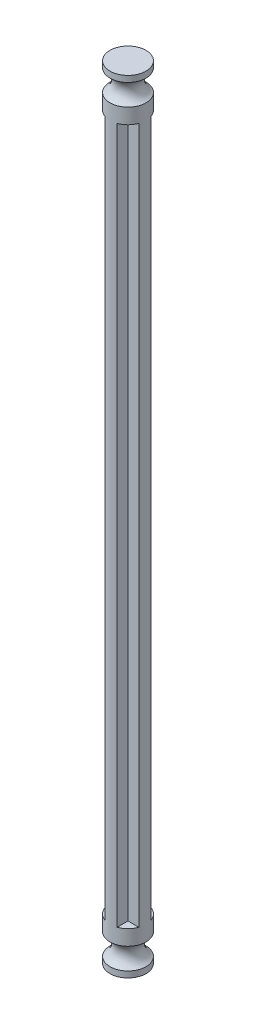
ISO-10303-21;
HEADER;
FILE_DESCRIPTION(('STEP AP214'),'2;1');
FILE_NAME('part.step','',(''),(''),'','','');
FILE_SCHEMA(('AUTOMOTIVE_DESIGN { 1 0 10303 214 1 1 1 1 }'));
ENDSEC;
DATA;
#1=APPLICATION_CONTEXT('core data for automotive mechanical design processes');
#2=APPLICATION_PROTOCOL_DEFINITION('international standard','automotive_design',2000,#1);
#3=PRODUCT_CONTEXT('',#1,'mechanical');
#4=PRODUCT('Part','Part','',(#3));
#5=PRODUCT_RELATED_PRODUCT_CATEGORY('part','',(#4));
#6=PRODUCT_DEFINITION_FORMATION('','',#4);
#7=PRODUCT_DEFINITION_CONTEXT('part definition',#1,'design');
#8=PRODUCT_DEFINITION('design','',#6,#7);
#9=PRODUCT_DEFINITION_SHAPE('','',#8);
#10=(LENGTH_UNIT() NAMED_UNIT(*) SI_UNIT(.MILLI.,.METRE.));
#11=(NAMED_UNIT(*) PLANE_ANGLE_UNIT() SI_UNIT($,.RADIAN.));
#12=(NAMED_UNIT(*) SI_UNIT($,.STERADIAN.) SOLID_ANGLE_UNIT());
#13=UNCERTAINTY_MEASURE_WITH_UNIT(LENGTH_MEASURE(1.E-05),#10,'distance_accuracy_value','');
#14=(GEOMETRIC_REPRESENTATION_CONTEXT(3) GLOBAL_UNCERTAINTY_ASSIGNED_CONTEXT((#13)) GLOBAL_UNIT_ASSIGNED_CONTEXT((#10,
#11,#12)) REPRESENTATION_CONTEXT('',''));
#15=CARTESIAN_POINT('',(0.,0.,0.));
#16=DIRECTION('',(0.,0.,1.));
#17=DIRECTION('',(1.,0.,0.));
#18=AXIS2_PLACEMENT_3D('',#15,#16,#17);
#19=CARTESIAN_POINT('',(1.,114.,1.));
#20=DIRECTION('',(-1.,0.,0.));
#21=DIRECTION('',(0.,0.,1.));
#22=AXIS2_PLACEMENT_3D('',#19,#20,#21);
#23=PLANE('',#22);
#24=DIRECTION('',(0.,0.,-1.));
#25=VECTOR('',#24,1.);
#26=CARTESIAN_POINT('',(1.,0.,1.));
#27=LINE('',#26,#25);
#28=CARTESIAN_POINT('',(1.,0.,2.77533781727558));
#29=VERTEX_POINT('',#28);
#30=CARTESIAN_POINT('',(1.,0.,1.));
#31=VERTEX_POINT('',#30);
#32=EDGE_CURVE('E122',#29,#31,#27,.T.);
#33=ORIENTED_EDGE('',*,*,#32,.T.);
#34=DIRECTION('',(0.,-1.,0.));
#35=VECTOR('',#34,1.);
#36=CARTESIAN_POINT('',(1.,114.,1.));
#37=LINE('',#36,#35);
#38=CARTESIAN_POINT('',(1.,114.,1.));
#39=VERTEX_POINT('',#38);
#40=EDGE_CURVE('E11',#39,#31,#37,.T.);
#41=ORIENTED_EDGE('',*,*,#40,.F.);
#42=DIRECTION('',(0.,0.,-1.));
#43=VECTOR('',#42,1.);
#44=CARTESIAN_POINT('',(1.,114.,1.));
#45=LINE('',#44,#43);
#46=CARTESIAN_POINT('',(0.999999999999999,114.,2.77533781727558));
#47=VERTEX_POINT('',#46);
#48=EDGE_CURVE('E139',#47,#39,#45,.T.);
#49=ORIENTED_EDGE('',*,*,#48,.F.);
#50=DIRECTION('',(0.,-1.,0.));
#51=VECTOR('',#50,1.);
#52=CARTESIAN_POINT('',(0.999999999999999,114.,2.77533781727558));
#53=LINE('',#52,#51);
#54=EDGE_CURVE('E52',#47,#29,#53,.T.);
#55=ORIENTED_EDGE('',*,*,#54,.T.);
#56=EDGE_LOOP('',(#33,#41,#49,#55));
#57=FACE_BOUND('',#56,.T.);
#58=ADVANCED_FACE('F37',(#57),#23,.F.);
#59=CARTESIAN_POINT('',(1.,114.,1.));
#60=DIRECTION('',(0.,0.,-1.));
#61=DIRECTION('',(-1.,0.,0.));
#62=AXIS2_PLACEMENT_3D('',#59,#60,#61);
#63=PLANE('',#62);
#64=DIRECTION('',(1.,0.,0.));
#65=VECTOR('',#64,1.);
#66=CARTESIAN_POINT('',(1.,0.,1.));
#67=LINE('',#66,#65);
#68=CARTESIAN_POINT('',(2.77533781727558,0.,1.));
#69=VERTEX_POINT('',#68);
#70=EDGE_CURVE('E126',#31,#69,#67,.T.);
#71=ORIENTED_EDGE('',*,*,#70,.T.);
#72=DIRECTION('',(0.,-1.,0.));
#73=VECTOR('',#72,1.);
#74=CARTESIAN_POINT('',(2.77533781727558,114.,1.));
#75=LINE('',#74,#73);
#76=CARTESIAN_POINT('',(2.77533781727558,114.,1.));
#77=VERTEX_POINT('',#76);
#78=EDGE_CURVE('E45',#77,#69,#75,.T.);
#79=ORIENTED_EDGE('',*,*,#78,.F.);
#80=DIRECTION('',(1.,0.,0.));
#81=VECTOR('',#80,1.);
#82=CARTESIAN_POINT('',(1.,114.,1.));
#83=LINE('',#82,#81);
#84=EDGE_CURVE('E213',#39,#77,#83,.T.);
#85=ORIENTED_EDGE('',*,*,#84,.F.);
#86=ORIENTED_EDGE('',*,*,#40,.T.);
#87=EDGE_LOOP('',(#71,#79,#85,#86));
#88=FACE_BOUND('',#87,.T.);
#89=ADVANCED_FACE('F277',(#88),#63,.F.);
#90=CARTESIAN_POINT('',(1.,114.,-1.));
#91=DIRECTION('',(0.,0.,1.));
#92=DIRECTION('',(1.,0.,0.));
#93=AXIS2_PLACEMENT_3D('',#90,#91,#92);
#94=PLANE('',#93);
#95=DIRECTION('',(-1.,0.,0.));
#96=VECTOR('',#95,1.);
#97=CARTESIAN_POINT('',(1.,0.,-1.));
#98=LINE('',#97,#96);
#99=CARTESIAN_POINT('',(2.77533781727558,0.,-1.));
#100=VERTEX_POINT('',#99);
#101=CARTESIAN_POINT('',(1.,0.,-1.));
#102=VERTEX_POINT('',#101);
#103=EDGE_CURVE('E180',#100,#102,#98,.T.);
#104=ORIENTED_EDGE('',*,*,#103,.T.);
#105=DIRECTION('',(0.,-1.,0.));
#106=VECTOR('',#105,1.);
#107=CARTESIAN_POINT('',(1.,114.,-1.));
#108=LINE('',#107,#106);
#109=CARTESIAN_POINT('',(1.,114.,-1.));
#110=VERTEX_POINT('',#109);
#111=EDGE_CURVE('E171',#110,#102,#108,.T.);
#112=ORIENTED_EDGE('',*,*,#111,.F.);
#113=DIRECTION('',(-1.,0.,0.));
#114=VECTOR('',#113,1.);
#115=CARTESIAN_POINT('',(1.,114.,-1.));
#116=LINE('',#115,#114);
#117=CARTESIAN_POINT('',(2.77533781727558,114.,-1.));
#118=VERTEX_POINT('',#117);
#119=EDGE_CURVE('E182',#118,#110,#116,.T.);
#120=ORIENTED_EDGE('',*,*,#119,.F.);
#121=DIRECTION('',(0.,-1.,0.));
#122=VECTOR('',#121,1.);
#123=CARTESIAN_POINT('',(2.77533781727558,114.,-1.));
#124=LINE('',#123,#122);
#125=EDGE_CURVE('E174',#118,#100,#124,.T.);
#126=ORIENTED_EDGE('',*,*,#125,.T.);
#127=EDGE_LOOP('',(#104,#112,#120,#126));
#128=FACE_BOUND('',#127,.T.);
#129=ADVANCED_FACE('F179',(#128),#94,.F.);
#130=CARTESIAN_POINT('',(1.,114.,-1.));
#131=DIRECTION('',(-1.,0.,0.));
#132=DIRECTION('',(0.,0.,1.));
#133=AXIS2_PLACEMENT_3D('',#130,#131,#132);
#134=PLANE('',#133);
#135=DIRECTION('',(0.,0.,-1.));
#136=VECTOR('',#135,1.);
#137=CARTESIAN_POINT('',(1.,0.,-1.));
#138=LINE('',#137,#136);
#139=CARTESIAN_POINT('',(0.999999999999999,0.,-2.77533781727558));
#140=VERTEX_POINT('',#139);
#141=EDGE_CURVE('E230',#102,#140,#138,.T.);
#142=ORIENTED_EDGE('',*,*,#141,.T.);
#143=DIRECTION('',(0.,-1.,0.));
#144=VECTOR('',#143,1.);
#145=CARTESIAN_POINT('',(1.,114.,-2.77533781727558));
#146=LINE('',#145,#144);
#147=CARTESIAN_POINT('',(1.,114.,-2.77533781727558));
#148=VERTEX_POINT('',#147);
#149=EDGE_CURVE('E168',#148,#140,#146,.T.);
#150=ORIENTED_EDGE('',*,*,#149,.F.);
#151=DIRECTION('',(0.,0.,-1.));
#152=VECTOR('',#151,1.);
#153=CARTESIAN_POINT('',(1.,114.,-1.));
#154=LINE('',#153,#152);
#155=EDGE_CURVE('E217',#110,#148,#154,.T.);
#156=ORIENTED_EDGE('',*,*,#155,.F.);
#157=ORIENTED_EDGE('',*,*,#111,.T.);
#158=EDGE_LOOP('',(#142,#150,#156,#157));
#159=FACE_BOUND('',#158,.T.);
#160=ADVANCED_FACE('F266',(#159),#134,.F.);
#161=CARTESIAN_POINT('',(-1.,114.,-1.));
#162=DIRECTION('',(1.,0.,0.));
#163=DIRECTION('',(0.,0.,-1.));
#164=AXIS2_PLACEMENT_3D('',#161,#162,#163);
#165=PLANE('',#164);
#166=DIRECTION('',(0.,0.,1.));
#167=VECTOR('',#166,1.);
#168=CARTESIAN_POINT('',(-1.,0.,-1.));
#169=LINE('',#168,#167);
#170=CARTESIAN_POINT('',(-1.,0.,-2.77533781727558));
#171=VERTEX_POINT('',#170);
#172=CARTESIAN_POINT('',(-1.,0.,-1.));
#173=VERTEX_POINT('',#172);
#174=EDGE_CURVE('E232',#171,#173,#169,.T.);
#175=ORIENTED_EDGE('',*,*,#174,.T.);
#176=DIRECTION('',(0.,-1.,0.));
#177=VECTOR('',#176,1.);
#178=CARTESIAN_POINT('',(-1.,114.,-1.));
#179=LINE('',#178,#177);
#180=CARTESIAN_POINT('',(-1.,114.,-1.));
#181=VERTEX_POINT('',#180);
#182=EDGE_CURVE('E162',#181,#173,#179,.T.);
#183=ORIENTED_EDGE('',*,*,#182,.F.);
#184=DIRECTION('',(0.,0.,1.));
#185=VECTOR('',#184,1.);
#186=CARTESIAN_POINT('',(-1.,114.,-1.));
#187=LINE('',#186,#185);
#188=CARTESIAN_POINT('',(-1.,114.,-2.77533781727558));
#189=VERTEX_POINT('',#188);
#190=EDGE_CURVE('E220',#189,#181,#187,.T.);
#191=ORIENTED_EDGE('',*,*,#190,.F.);
#192=DIRECTION('',(0.,-1.,0.));
#193=VECTOR('',#192,1.);
#194=CARTESIAN_POINT('',(-1.,114.,-2.77533781727558));
#195=LINE('',#194,#193);
#196=EDGE_CURVE('E165',#189,#171,#195,.T.);
#197=ORIENTED_EDGE('',*,*,#196,.T.);
#198=EDGE_LOOP('',(#175,#183,#191,#197));
#199=FACE_BOUND('',#198,.T.);
#200=ADVANCED_FACE('F264',(#199),#165,.F.);
#201=CARTESIAN_POINT('',(-1.,114.,-1.));
#202=DIRECTION('',(0.,0.,1.));
#203=DIRECTION('',(1.,0.,0.));
#204=AXIS2_PLACEMENT_3D('',#201,#202,#203);
#205=PLANE('',#204);
#206=DIRECTION('',(-1.,0.,0.));
#207=VECTOR('',#206,1.);
#208=CARTESIAN_POINT('',(-1.,0.,-1.));
#209=LINE('',#208,#207);
#210=CARTESIAN_POINT('',(-2.77533781727558,0.,-1.));
#211=VERTEX_POINT('',#210);
#212=EDGE_CURVE('E235',#173,#211,#209,.T.);
#213=ORIENTED_EDGE('',*,*,#212,.T.);
#214=DIRECTION('',(0.,-1.,0.));
#215=VECTOR('',#214,1.);
#216=CARTESIAN_POINT('',(-2.77533781727558,114.,-1.));
#217=LINE('',#216,#215);
#218=CARTESIAN_POINT('',(-2.77533781727558,114.,-1.));
#219=VERTEX_POINT('',#218);
#220=EDGE_CURVE('E159',#219,#211,#217,.T.);
#221=ORIENTED_EDGE('',*,*,#220,.F.);
#222=DIRECTION('',(-1.,0.,0.));
#223=VECTOR('',#222,1.);
#224=CARTESIAN_POINT('',(-1.,114.,-1.));
#225=LINE('',#224,#223);
#226=EDGE_CURVE('E223',#181,#219,#225,.T.);
#227=ORIENTED_EDGE('',*,*,#226,.F.);
#228=ORIENTED_EDGE('',*,*,#182,.T.);
#229=EDGE_LOOP('',(#213,#221,#227,#228));
#230=FACE_BOUND('',#229,.T.);
#231=ADVANCED_FACE('F260',(#230),#205,.F.);
#232=CARTESIAN_POINT('',(-1.,114.,1.));
#233=DIRECTION('',(0.,0.,-1.));
#234=DIRECTION('',(-1.,0.,0.));
#235=AXIS2_PLACEMENT_3D('',#232,#233,#234);
#236=PLANE('',#235);
#237=DIRECTION('',(1.,0.,0.));
#238=VECTOR('',#237,1.);
#239=CARTESIAN_POINT('',(-1.,0.,1.));
#240=LINE('',#239,#238);
#241=CARTESIAN_POINT('',(-2.77533781727558,0.,1.));
#242=VERTEX_POINT('',#241);
#243=CARTESIAN_POINT('',(-1.,0.,1.));
#244=VERTEX_POINT('',#243);
#245=EDGE_CURVE('E237',#242,#244,#240,.T.);
#246=ORIENTED_EDGE('',*,*,#245,.T.);
#247=DIRECTION('',(0.,-1.,0.));
#248=VECTOR('',#247,1.);
#249=CARTESIAN_POINT('',(-1.,114.,1.));
#250=LINE('',#249,#248);
#251=CARTESIAN_POINT('',(-1.,114.,1.));
#252=VERTEX_POINT('',#251);
#253=EDGE_CURVE('E145',#252,#244,#250,.T.);
#254=ORIENTED_EDGE('',*,*,#253,.F.);
#255=DIRECTION('',(1.,0.,0.));
#256=VECTOR('',#255,1.);
#257=CARTESIAN_POINT('',(-1.,114.,1.));
#258=LINE('',#257,#256);
#259=CARTESIAN_POINT('',(-2.77533781727558,114.,0.999999999999999));
#260=VERTEX_POINT('',#259);
#261=EDGE_CURVE('E148',#260,#252,#258,.T.);
#262=ORIENTED_EDGE('',*,*,#261,.F.);
#263=DIRECTION('',(0.,-1.,0.));
#264=VECTOR('',#263,1.);
#265=CARTESIAN_POINT('',(-2.77533781727558,114.,0.999999999999999));
#266=LINE('',#265,#264);
#267=EDGE_CURVE('E156',#260,#242,#266,.T.);
#268=ORIENTED_EDGE('',*,*,#267,.T.);
#269=EDGE_LOOP('',(#246,#254,#262,#268));
#270=FACE_BOUND('',#269,.T.);
#271=ADVANCED_FACE('F272',(#270),#236,.F.);
#272=CARTESIAN_POINT('',(-1.,114.,1.));
#273=DIRECTION('',(1.,0.,0.));
#274=DIRECTION('',(0.,0.,-1.));
#275=AXIS2_PLACEMENT_3D('',#272,#273,#274);
#276=PLANE('',#275);
#277=DIRECTION('',(0.,0.,1.));
#278=VECTOR('',#277,1.);
#279=CARTESIAN_POINT('',(-1.,0.,1.));
#280=LINE('',#279,#278);
#281=CARTESIAN_POINT('',(-0.999999999999999,0.,2.77533781727558));
#282=VERTEX_POINT('',#281);
#283=EDGE_CURVE('E151',#244,#282,#280,.T.);
#284=ORIENTED_EDGE('',*,*,#283,.T.);
#285=DIRECTION('',(0.,-1.,0.));
#286=VECTOR('',#285,1.);
#287=CARTESIAN_POINT('',(-1.,114.,2.77533781727558));
#288=LINE('',#287,#286);
#289=CARTESIAN_POINT('',(-0.999999999999999,114.,2.77533781727561));
#290=VERTEX_POINT('',#289);
#291=EDGE_CURVE('E141',#290,#282,#288,.T.);
#292=ORIENTED_EDGE('',*,*,#291,.F.);
#293=DIRECTION('',(0.,0.,1.));
#294=VECTOR('',#293,1.);
#295=CARTESIAN_POINT('',(-1.,114.,1.));
#296=LINE('',#295,#294);
#297=EDGE_CURVE('E142',#252,#290,#296,.T.);
#298=ORIENTED_EDGE('',*,*,#297,.F.);
#299=ORIENTED_EDGE('',*,*,#253,.T.);
#300=EDGE_LOOP('',(#284,#292,#298,#299));
#301=FACE_BOUND('',#300,.T.);
#302=ADVANCED_FACE('F242',(#301),#276,.F.);
#303=CARTESIAN_POINT('',(0.,114.,0.));
#304=DIRECTION('',(0.,-1.,0.));
#305=DIRECTION('',(0.,0.,-1.));
#306=AXIS2_PLACEMENT_3D('',#303,#304,#305);
#307=CYLINDRICAL_SURFACE('',#306,2.95);
#308=CARTESIAN_POINT('',(0.,0.,0.));
#309=DIRECTION('',(0.,1.,0.));
#310=DIRECTION('',(0.,0.,1.));
#311=AXIS2_PLACEMENT_3D('',#308,#309,#310);
#312=CIRCLE('',#311,2.95);
#313=EDGE_CURVE('E124',#29,#69,#312,.T.);
#314=ORIENTED_EDGE('',*,*,#313,.F.);
#315=ORIENTED_EDGE('',*,*,#54,.F.);
#316=CARTESIAN_POINT('',(0.,114.,0.));
#317=DIRECTION('',(0.,1.,0.));
#318=DIRECTION('',(0.,0.,1.));
#319=AXIS2_PLACEMENT_3D('',#316,#317,#318);
#320=CIRCLE('',#319,2.95000000000001);
#321=EDGE_CURVE('E129',#47,#77,#320,.T.);
#322=ORIENTED_EDGE('',*,*,#321,.T.);
#323=ORIENTED_EDGE('',*,*,#78,.T.);
#324=EDGE_LOOP('',(#314,#315,#322,#323));
#325=FACE_BOUND('',#324,.T.);
#326=EDGE_CURVE('E137',#242,#282,#312,.T.);
#327=ORIENTED_EDGE('',*,*,#326,.F.);
#328=ORIENTED_EDGE('',*,*,#267,.F.);
#329=EDGE_CURVE('E210',#260,#290,#320,.T.);
#330=ORIENTED_EDGE('',*,*,#329,.T.);
#331=ORIENTED_EDGE('',*,*,#291,.T.);
#332=EDGE_LOOP('',(#327,#328,#330,#331));
#333=FACE_BOUND('',#332,.T.);
#334=EDGE_CURVE('E191',#171,#211,#312,.T.);
#335=ORIENTED_EDGE('',*,*,#334,.F.);
#336=ORIENTED_EDGE('',*,*,#196,.F.);
#337=EDGE_CURVE('E251',#189,#219,#320,.T.);
#338=ORIENTED_EDGE('',*,*,#337,.T.);
#339=ORIENTED_EDGE('',*,*,#220,.T.);
#340=EDGE_LOOP('',(#335,#336,#338,#339));
#341=FACE_BOUND('',#340,.T.);
#342=ORIENTED_EDGE('',*,*,#149,.T.);
#343=EDGE_CURVE('E135',#100,#140,#312,.T.);
#344=ORIENTED_EDGE('',*,*,#343,.F.);
#345=ORIENTED_EDGE('',*,*,#125,.F.);
#346=EDGE_CURVE('E188',#118,#148,#320,.T.);
#347=ORIENTED_EDGE('',*,*,#346,.T.);
#348=EDGE_LOOP('',(#342,#344,#345,#347));
#349=FACE_BOUND('',#348,.T.);
#350=CARTESIAN_POINT('',(0.,116.5,0.));
#351=DIRECTION('',(0.,1.,0.));
#352=DIRECTION('',(0.,0.,1.));
#353=AXIS2_PLACEMENT_3D('',#350,#351,#352);
#354=CIRCLE('',#353,2.95000000000001);
#355=CARTESIAN_POINT('',(0.,116.5,2.95000000000003));
#356=VERTEX_POINT('',#355);
#357=EDGE_CURVE('E207',#356,#356,#354,.T.);
#358=ORIENTED_EDGE('',*,*,#357,.F.);
#359=EDGE_LOOP('',(#358));
#360=FACE_BOUND('',#359,.T.);
#361=CARTESIAN_POINT('',(0.,-2.5,0.));
#362=DIRECTION('',(0.,1.,0.));
#363=DIRECTION('',(0.,0.,1.));
#364=AXIS2_PLACEMENT_3D('',#361,#362,#363);
#365=CIRCLE('',#364,2.95);
#366=CARTESIAN_POINT('',(0.,-2.5,2.95));
#367=VERTEX_POINT('',#366);
#368=EDGE_CURVE('E134',#367,#367,#365,.T.);
#369=ORIENTED_EDGE('',*,*,#368,.T.);
#370=EDGE_LOOP('',(#369));
#371=FACE_BOUND('',#370,.T.);
#372=ADVANCED_FACE('F132',(#325,#333,#341,#349,#360,#371),#307,.T.);
#373=CARTESIAN_POINT('',(0.,114.,0.));
#374=DIRECTION('',(0.,1.,0.));
#375=DIRECTION('',(0.,0.,1.));
#376=AXIS2_PLACEMENT_3D('',#373,#374,#375);
#377=PLANE('',#376);
#378=ORIENTED_EDGE('',*,*,#321,.F.);
#379=ORIENTED_EDGE('',*,*,#48,.T.);
#380=ORIENTED_EDGE('',*,*,#84,.T.);
#381=EDGE_LOOP('',(#378,#379,#380));
#382=FACE_BOUND('',#381,.T.);
#383=ADVANCED_FACE('F287',(#382),#377,.F.);
#384=ORIENTED_EDGE('',*,*,#346,.F.);
#385=ORIENTED_EDGE('',*,*,#119,.T.);
#386=ORIENTED_EDGE('',*,*,#155,.T.);
#387=EDGE_LOOP('',(#384,#385,#386));
#388=FACE_BOUND('',#387,.T.);
#389=ADVANCED_FACE('F289',(#388),#377,.F.);
#390=ORIENTED_EDGE('',*,*,#337,.F.);
#391=ORIENTED_EDGE('',*,*,#190,.T.);
#392=ORIENTED_EDGE('',*,*,#226,.T.);
#393=EDGE_LOOP('',(#390,#391,#392));
#394=FACE_BOUND('',#393,.T.);
#395=ADVANCED_FACE('F257',(#394),#377,.F.);
#396=ORIENTED_EDGE('',*,*,#329,.F.);
#397=ORIENTED_EDGE('',*,*,#261,.T.);
#398=ORIENTED_EDGE('',*,*,#297,.T.);
#399=EDGE_LOOP('',(#396,#397,#398));
#400=FACE_BOUND('',#399,.T.);
#401=ADVANCED_FACE('F291',(#400),#377,.F.);
#402=CARTESIAN_POINT('',(0.,118.25,0.));
#403=DIRECTION('',(0.,1.,0.));
#404=DIRECTION('',(0.,0.,1.));
#405=AXIS2_PLACEMENT_3D('',#402,#403,#404);
#406=TOROIDAL_SURFACE('',#405,3.91824583655187,2.);
#407=CARTESIAN_POINT('',(0.,120.,0.));
#408=DIRECTION('',(0.,1.,0.));
#409=DIRECTION('',(0.,0.,1.));
#410=AXIS2_PLACEMENT_3D('',#407,#408,#409);
#411=CIRCLE('',#410,2.95000000000002);
#412=CARTESIAN_POINT('',(0.,120.,2.95000000000003));
#413=VERTEX_POINT('',#412);
#414=EDGE_CURVE('E204',#413,#413,#411,.T.);
#415=ORIENTED_EDGE('',*,*,#414,.F.);
#416=EDGE_LOOP('',(#415));
#417=FACE_BOUND('',#416,.T.);
#418=ORIENTED_EDGE('',*,*,#357,.T.);
#419=EDGE_LOOP('',(#418));
#420=FACE_BOUND('',#419,.T.);
#421=ADVANCED_FACE('F300',(#417,#420),#406,.F.);
#422=CARTESIAN_POINT('',(0.,0.,0.));
#423=DIRECTION('',(0.,1.,0.));
#424=DIRECTION('',(0.,0.,1.));
#425=AXIS2_PLACEMENT_3D('',#422,#423,#424);
#426=CYLINDRICAL_SURFACE('',#425,2.95000000000002);
#427=CARTESIAN_POINT('',(0.,121.,0.));
#428=DIRECTION('',(0.,1.,0.));
#429=DIRECTION('',(0.,0.,1.));
#430=AXIS2_PLACEMENT_3D('',#427,#428,#429);
#431=CIRCLE('',#430,2.95000000000002);
#432=CARTESIAN_POINT('',(0.,121.,2.95000000000003));
#433=VERTEX_POINT('',#432);
#434=EDGE_CURVE('E201',#433,#433,#431,.T.);
#435=ORIENTED_EDGE('',*,*,#434,.F.);
#436=EDGE_LOOP('',(#435));
#437=FACE_BOUND('',#436,.T.);
#438=ORIENTED_EDGE('',*,*,#414,.T.);
#439=EDGE_LOOP('',(#438));
#440=FACE_BOUND('',#439,.T.);
#441=ADVANCED_FACE('F305',(#437,#440),#426,.T.);
#442=CARTESIAN_POINT('',(0.,121.,0.));
#443=DIRECTION('',(0.,-1.,0.));
#444=DIRECTION('',(0.,0.,-1.));
#445=AXIS2_PLACEMENT_3D('',#442,#443,#444);
#446=PLANE('',#445);
#447=ORIENTED_EDGE('',*,*,#434,.T.);
#448=EDGE_LOOP('',(#447));
#449=FACE_BOUND('',#448,.T.);
#450=ADVANCED_FACE('F405',(#449),#446,.F.);
#451=CARTESIAN_POINT('',(0.,0.,0.));
#452=DIRECTION('',(0.,-1.,0.));
#453=DIRECTION('',(0.,0.,-1.));
#454=AXIS2_PLACEMENT_3D('',#451,#452,#453);
#455=PLANE('',#454);
#456=ORIENTED_EDGE('',*,*,#283,.F.);
#457=ORIENTED_EDGE('',*,*,#245,.F.);
#458=ORIENTED_EDGE('',*,*,#326,.T.);
#459=EDGE_LOOP('',(#456,#457,#458));
#460=FACE_BOUND('',#459,.T.);
#461=ADVANCED_FACE('F414',(#460),#455,.F.);
#462=ORIENTED_EDGE('',*,*,#212,.F.);
#463=ORIENTED_EDGE('',*,*,#174,.F.);
#464=ORIENTED_EDGE('',*,*,#334,.T.);
#465=EDGE_LOOP('',(#462,#463,#464));
#466=FACE_BOUND('',#465,.T.);
#467=ADVANCED_FACE('F262',(#466),#455,.F.);
#468=ORIENTED_EDGE('',*,*,#141,.F.);
#469=ORIENTED_EDGE('',*,*,#103,.F.);
#470=ORIENTED_EDGE('',*,*,#343,.T.);
#471=EDGE_LOOP('',(#468,#469,#470));
#472=FACE_BOUND('',#471,.T.);
#473=ADVANCED_FACE('F430',(#472),#455,.F.);
#474=ORIENTED_EDGE('',*,*,#32,.F.);
#475=ORIENTED_EDGE('',*,*,#313,.T.);
#476=ORIENTED_EDGE('',*,*,#70,.F.);
#477=EDGE_LOOP('',(#474,#475,#476));
#478=FACE_BOUND('',#477,.T.);
#479=ADVANCED_FACE('F123',(#478),#455,.F.);
#480=CARTESIAN_POINT('',(0.,-7.,0.));
#481=DIRECTION('',(0.,1.,0.));
#482=DIRECTION('',(0.,0.,1.));
#483=AXIS2_PLACEMENT_3D('',#480,#481,#482);
#484=PLANE('',#483);
#485=CARTESIAN_POINT('',(0.,-7.,0.));
#486=DIRECTION('',(0.,1.,0.));
#487=DIRECTION('',(0.,0.,1.));
#488=AXIS2_PLACEMENT_3D('',#485,#486,#487);
#489=CIRCLE('',#488,2.95);
#490=CARTESIAN_POINT('',(0.,-7.,2.95));
#491=VERTEX_POINT('',#490);
#492=EDGE_CURVE('E198',#491,#491,#489,.T.);
#493=ORIENTED_EDGE('',*,*,#492,.F.);
#494=EDGE_LOOP('',(#493));
#495=FACE_BOUND('',#494,.T.);
#496=ADVANCED_FACE('F443',(#495),#484,.F.);
#497=CARTESIAN_POINT('',(0.,0.,0.));
#498=DIRECTION('',(0.,1.,0.));
#499=DIRECTION('',(0.,0.,1.));
#500=AXIS2_PLACEMENT_3D('',#497,#498,#499);
#501=CYLINDRICAL_SURFACE('',#500,2.95);
#502=CARTESIAN_POINT('',(0.,-6.,0.));
#503=DIRECTION('',(0.,1.,0.));
#504=DIRECTION('',(0.,0.,1.));
#505=AXIS2_PLACEMENT_3D('',#502,#503,#504);
#506=CIRCLE('',#505,2.95);
#507=CARTESIAN_POINT('',(0.,-6.,2.95));
#508=VERTEX_POINT('',#507);
#509=EDGE_CURVE('E195',#508,#508,#506,.T.);
#510=ORIENTED_EDGE('',*,*,#509,.F.);
#511=EDGE_LOOP('',(#510));
#512=FACE_BOUND('',#511,.T.);
#513=ORIENTED_EDGE('',*,*,#492,.T.);
#514=EDGE_LOOP('',(#513));
#515=FACE_BOUND('',#514,.T.);
#516=ADVANCED_FACE('F450',(#512,#515),#501,.T.);
#517=CARTESIAN_POINT('',(0.,-4.25,0.));
#518=DIRECTION('',(0.,1.,0.));
#519=DIRECTION('',(0.,0.,1.));
#520=AXIS2_PLACEMENT_3D('',#517,#518,#519);
#521=TOROIDAL_SURFACE('',#520,3.91824583655185,2.);
#522=ORIENTED_EDGE('',*,*,#368,.F.);
#523=EDGE_LOOP('',(#522));
#524=FACE_BOUND('',#523,.T.);
#525=ORIENTED_EDGE('',*,*,#509,.T.);
#526=EDGE_LOOP('',(#525));
#527=FACE_BOUND('',#526,.T.);
#528=ADVANCED_FACE('F459',(#524,#527),#521,.F.);
#529=CLOSED_SHELL('',(#58,#89,#129,#160,#200,#231,#271,#302,#372,#383,#389,#395,#401,#421,#441,
#450,#461,#467,#473,#479,#496,#516,#528));
#530=MANIFOLD_SOLID_BREP('B2',#529);
#531=ADVANCED_BREP_SHAPE_REPRESENTATION('',(#18,#530),#14);
#532=SHAPE_DEFINITION_REPRESENTATION(#9,#531);
ENDSEC;
END-ISO-10303-21;
